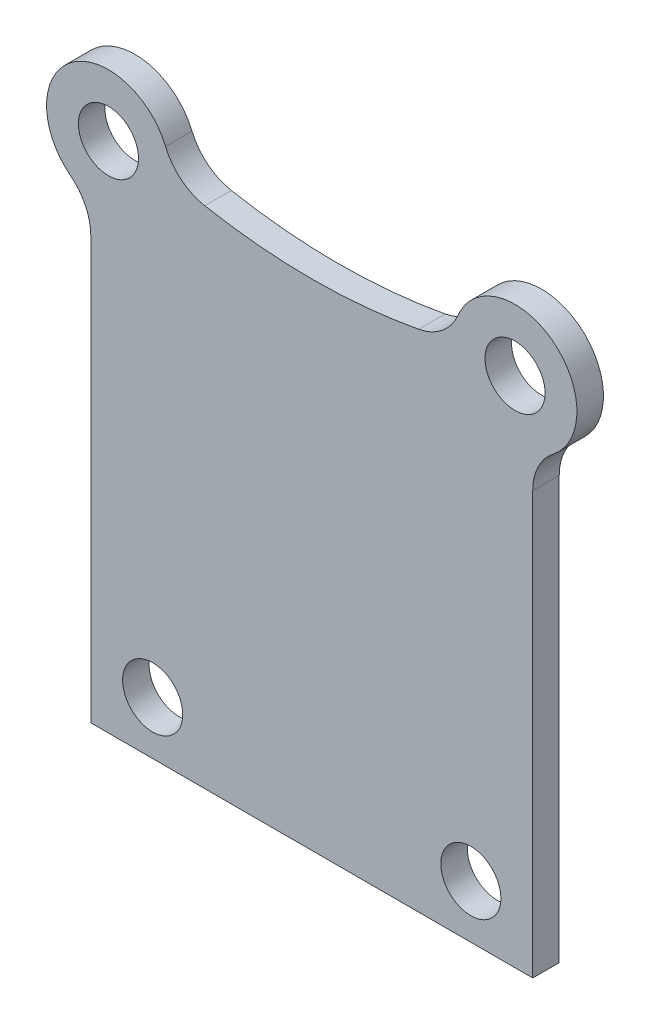
ISO-10303-21;
HEADER;
FILE_DESCRIPTION(('STEP AP214'),'2;1');
FILE_NAME('part.step','',(''),(''),'','','');
FILE_SCHEMA(('AUTOMOTIVE_DESIGN { 1 0 10303 214 1 1 1 1 }'));
ENDSEC;
DATA;
#1=APPLICATION_CONTEXT('core data for automotive mechanical design processes');
#2=APPLICATION_PROTOCOL_DEFINITION('international standard','automotive_design',2000,#1);
#3=PRODUCT_CONTEXT('',#1,'mechanical');
#4=PRODUCT('Part','Part','',(#3));
#5=PRODUCT_RELATED_PRODUCT_CATEGORY('part','',(#4));
#6=PRODUCT_DEFINITION_FORMATION('','',#4);
#7=PRODUCT_DEFINITION_CONTEXT('part definition',#1,'design');
#8=PRODUCT_DEFINITION('design','',#6,#7);
#9=PRODUCT_DEFINITION_SHAPE('','',#8);
#10=(LENGTH_UNIT() NAMED_UNIT(*) SI_UNIT(.MILLI.,.METRE.));
#11=(NAMED_UNIT(*) PLANE_ANGLE_UNIT() SI_UNIT($,.RADIAN.));
#12=(NAMED_UNIT(*) SI_UNIT($,.STERADIAN.) SOLID_ANGLE_UNIT());
#13=UNCERTAINTY_MEASURE_WITH_UNIT(LENGTH_MEASURE(1.E-05),#10,'distance_accuracy_value','');
#14=(GEOMETRIC_REPRESENTATION_CONTEXT(3) GLOBAL_UNCERTAINTY_ASSIGNED_CONTEXT((#13)) GLOBAL_UNIT_ASSIGNED_CONTEXT((#10,
#11,#12)) REPRESENTATION_CONTEXT('',''));
#15=CARTESIAN_POINT('',(0.,0.,0.));
#16=DIRECTION('',(0.,0.,1.));
#17=DIRECTION('',(1.,0.,0.));
#18=AXIS2_PLACEMENT_3D('',#15,#16,#17);
#19=CARTESIAN_POINT('',(-15.5,-56.1234753829798,-1.5));
#20=DIRECTION('',(0.,0.,1.));
#21=DIRECTION('',(1.,0.,0.));
#22=AXIS2_PLACEMENT_3D('',#19,#20,#21);
#23=CYLINDRICAL_SURFACE('',#22,3.);
#24=CARTESIAN_POINT('',(-15.5,-56.1234753829798,0.));
#25=DIRECTION('',(0.,0.,-1.));
#26=DIRECTION('',(1.,0.,0.));
#27=AXIS2_PLACEMENT_3D('',#24,#25,#26);
#28=CIRCLE('',#27,3.);
#29=CARTESIAN_POINT('',(-13.6538461538462,-53.7587944369891,0.));
#30=VERTEX_POINT('',#29);
#31=CARTESIAN_POINT('',(-12.5,-56.1234753829798,0.));
#32=VERTEX_POINT('',#31);
#33=EDGE_CURVE('E143',#30,#32,#28,.T.);
#34=ORIENTED_EDGE('',*,*,#33,.F.);
#35=DIRECTION('',(0.,0.,1.));
#36=VECTOR('',#35,1.);
#37=CARTESIAN_POINT('',(-13.6538461538462,-53.7587944369891,-1.5));
#38=LINE('',#37,#36);
#39=CARTESIAN_POINT('',(-13.6538461538462,-53.7587944369891,-1.5));
#40=VERTEX_POINT('',#39);
#41=EDGE_CURVE('E11',#40,#30,#38,.T.);
#42=ORIENTED_EDGE('',*,*,#41,.F.);
#43=CARTESIAN_POINT('',(-15.5,-56.1234753829798,-1.5));
#44=DIRECTION('',(0.,0.,-1.));
#45=DIRECTION('',(1.,0.,0.));
#46=AXIS2_PLACEMENT_3D('',#43,#44,#45);
#47=CIRCLE('',#46,3.);
#48=CARTESIAN_POINT('',(-12.5,-56.1234753829798,-1.5));
#49=VERTEX_POINT('',#48);
#50=EDGE_CURVE('E170',#40,#49,#47,.T.);
#51=ORIENTED_EDGE('',*,*,#50,.T.);
#52=DIRECTION('',(0.,0.,1.));
#53=VECTOR('',#52,1.);
#54=CARTESIAN_POINT('',(-12.5,-56.1234753829798,-1.5));
#55=LINE('',#54,#53);
#56=EDGE_CURVE('E37',#49,#32,#55,.T.);
#57=ORIENTED_EDGE('',*,*,#56,.T.);
#58=EDGE_LOOP('',(#34,#42,#51,#57));
#59=FACE_BOUND('',#58,.T.);
#60=ADVANCED_FACE('F34',(#59),#23,.F.);
#61=CARTESIAN_POINT('',(-11.5,-51.,-1.5));
#62=DIRECTION('',(0.,0.,1.));
#63=DIRECTION('',(1.,0.,0.));
#64=AXIS2_PLACEMENT_3D('',#61,#62,#63);
#65=CYLINDRICAL_SURFACE('',#64,3.50000000000001);
#66=CARTESIAN_POINT('',(-11.5,-51.,0.));
#67=DIRECTION('',(0.,0.,1.));
#68=DIRECTION('',(1.,0.,0.));
#69=AXIS2_PLACEMENT_3D('',#66,#67,#68);
#70=CIRCLE('',#69,3.50000000000001);
#71=CARTESIAN_POINT('',(-8.27038440674473,-49.6510807586062,0.));
#72=VERTEX_POINT('',#71);
#73=EDGE_CURVE('E168',#72,#30,#70,.T.);
#74=ORIENTED_EDGE('',*,*,#73,.F.);
#75=DIRECTION('',(0.,0.,1.));
#76=VECTOR('',#75,1.);
#77=CARTESIAN_POINT('',(-8.27038440674473,-49.6510807586062,-1.5));
#78=LINE('',#77,#76);
#79=CARTESIAN_POINT('',(-8.27038440674473,-49.6510807586062,-1.5));
#80=VERTEX_POINT('',#79);
#81=EDGE_CURVE('E43',#80,#72,#78,.T.);
#82=ORIENTED_EDGE('',*,*,#81,.F.);
#83=CARTESIAN_POINT('',(-11.5,-51.,-1.5));
#84=DIRECTION('',(0.,0.,1.));
#85=DIRECTION('',(1.,0.,0.));
#86=AXIS2_PLACEMENT_3D('',#83,#84,#85);
#87=CIRCLE('',#86,3.50000000000001);
#88=EDGE_CURVE('E133',#80,#40,#87,.T.);
#89=ORIENTED_EDGE('',*,*,#88,.T.);
#90=ORIENTED_EDGE('',*,*,#41,.T.);
#91=EDGE_LOOP('',(#74,#82,#89,#90));
#92=FACE_BOUND('',#91,.T.);
#93=ADVANCED_FACE('F186',(#92),#65,.T.);
#94=CARTESIAN_POINT('',(-5.50214246966879,-48.494864265983,-1.5));
#95=DIRECTION('',(0.,0.,1.));
#96=DIRECTION('',(1.,0.,0.));
#97=AXIS2_PLACEMENT_3D('',#94,#95,#96);
#98=CYLINDRICAL_SURFACE('',#97,3.);
#99=CARTESIAN_POINT('',(-5.50214246966879,-48.494864265983,0.));
#100=DIRECTION('',(0.,0.,-1.));
#101=DIRECTION('',(1.,0.,0.));
#102=AXIS2_PLACEMENT_3D('',#99,#100,#101);
#103=CIRCLE('',#102,3.);
#104=CARTESIAN_POINT('',(-6.05228930032564,-51.4439892997376,0.));
#105=VERTEX_POINT('',#104);
#106=EDGE_CURVE('E120',#105,#72,#103,.T.);
#107=ORIENTED_EDGE('',*,*,#106,.F.);
#108=DIRECTION('',(0.,0.,1.));
#109=VECTOR('',#108,1.);
#110=CARTESIAN_POINT('',(-6.05228930032564,-51.4439892997376,-1.5));
#111=LINE('',#110,#109);
#112=CARTESIAN_POINT('',(-6.05228930032564,-51.4439892997376,-1.5));
#113=VERTEX_POINT('',#112);
#114=EDGE_CURVE('E115',#113,#105,#111,.T.);
#115=ORIENTED_EDGE('',*,*,#114,.F.);
#116=CARTESIAN_POINT('',(-5.50214246966879,-48.494864265983,-1.5));
#117=DIRECTION('',(0.,0.,-1.));
#118=DIRECTION('',(1.,0.,0.));
#119=AXIS2_PLACEMENT_3D('',#116,#117,#118);
#120=CIRCLE('',#119,3.);
#121=EDGE_CURVE('E118',#113,#80,#120,.T.);
#122=ORIENTED_EDGE('',*,*,#121,.T.);
#123=ORIENTED_EDGE('',*,*,#81,.T.);
#124=EDGE_LOOP('',(#107,#115,#122,#123));
#125=FACE_BOUND('',#124,.T.);
#126=ADVANCED_FACE('F117',(#125),#98,.F.);
#127=CARTESIAN_POINT('',(0.,-19.,-1.5));
#128=DIRECTION('',(0.,0.,1.));
#129=DIRECTION('',(1.,0.,0.));
#130=AXIS2_PLACEMENT_3D('',#127,#128,#129);
#131=CYLINDRICAL_SURFACE('',#130,33.0036762718386);
#132=CARTESIAN_POINT('',(0.,-19.,0.));
#133=DIRECTION('',(0.,0.,-1.));
#134=DIRECTION('',(1.,0.,0.));
#135=AXIS2_PLACEMENT_3D('',#132,#133,#134);
#136=CIRCLE('',#135,33.0036762718386);
#137=CARTESIAN_POINT('',(6.05228930032564,-51.4439892997376,0.));
#138=VERTEX_POINT('',#137);
#139=EDGE_CURVE('E165',#138,#105,#136,.T.);
#140=ORIENTED_EDGE('',*,*,#139,.F.);
#141=DIRECTION('',(0.,0.,1.));
#142=VECTOR('',#141,1.);
#143=CARTESIAN_POINT('',(6.05228930032564,-51.4439892997376,-1.5));
#144=LINE('',#143,#142);
#145=CARTESIAN_POINT('',(6.05228930032564,-51.4439892997376,-1.5));
#146=VERTEX_POINT('',#145);
#147=EDGE_CURVE('E125',#146,#138,#144,.T.);
#148=ORIENTED_EDGE('',*,*,#147,.F.);
#149=CARTESIAN_POINT('',(0.,-19.,-1.5));
#150=DIRECTION('',(0.,0.,-1.));
#151=DIRECTION('',(1.,0.,0.));
#152=AXIS2_PLACEMENT_3D('',#149,#150,#151);
#153=CIRCLE('',#152,33.0036762718386);
#154=EDGE_CURVE('E131',#146,#113,#153,.T.);
#155=ORIENTED_EDGE('',*,*,#154,.T.);
#156=ORIENTED_EDGE('',*,*,#114,.T.);
#157=EDGE_LOOP('',(#140,#148,#155,#156));
#158=FACE_BOUND('',#157,.T.);
#159=ADVANCED_FACE('F135',(#158),#131,.F.);
#160=CARTESIAN_POINT('',(5.50214246966878,-48.494864265983,-1.5));
#161=DIRECTION('',(0.,0.,1.));
#162=DIRECTION('',(1.,0.,0.));
#163=AXIS2_PLACEMENT_3D('',#160,#161,#162);
#164=CYLINDRICAL_SURFACE('',#163,3.);
#165=CARTESIAN_POINT('',(5.50214246966878,-48.494864265983,0.));
#166=DIRECTION('',(0.,0.,-1.));
#167=DIRECTION('',(1.,0.,0.));
#168=AXIS2_PLACEMENT_3D('',#165,#166,#167);
#169=CIRCLE('',#168,3.);
#170=CARTESIAN_POINT('',(8.27038440674472,-49.6510807586062,0.));
#171=VERTEX_POINT('',#170);
#172=EDGE_CURVE('E162',#171,#138,#169,.T.);
#173=ORIENTED_EDGE('',*,*,#172,.F.);
#174=DIRECTION('',(0.,0.,1.));
#175=VECTOR('',#174,1.);
#176=CARTESIAN_POINT('',(8.27038440674472,-49.6510807586062,-1.5));
#177=LINE('',#176,#175);
#178=CARTESIAN_POINT('',(8.27038440674472,-49.6510807586062,-1.5));
#179=VERTEX_POINT('',#178);
#180=EDGE_CURVE('E174',#179,#171,#177,.T.);
#181=ORIENTED_EDGE('',*,*,#180,.F.);
#182=CARTESIAN_POINT('',(5.50214246966878,-48.494864265983,-1.5));
#183=DIRECTION('',(0.,0.,-1.));
#184=DIRECTION('',(1.,0.,0.));
#185=AXIS2_PLACEMENT_3D('',#182,#183,#184);
#186=CIRCLE('',#185,3.);
#187=EDGE_CURVE('E136',#179,#146,#186,.T.);
#188=ORIENTED_EDGE('',*,*,#187,.T.);
#189=ORIENTED_EDGE('',*,*,#147,.T.);
#190=EDGE_LOOP('',(#173,#181,#188,#189));
#191=FACE_BOUND('',#190,.T.);
#192=ADVANCED_FACE('F199',(#191),#164,.F.);
#193=CARTESIAN_POINT('',(11.5,-51.,-1.5));
#194=DIRECTION('',(0.,0.,1.));
#195=DIRECTION('',(1.,0.,0.));
#196=AXIS2_PLACEMENT_3D('',#193,#194,#195);
#197=CYLINDRICAL_SURFACE('',#196,3.5);
#198=CARTESIAN_POINT('',(11.5,-51.,0.));
#199=DIRECTION('',(0.,0.,1.));
#200=DIRECTION('',(1.,0.,0.));
#201=AXIS2_PLACEMENT_3D('',#198,#199,#200);
#202=CIRCLE('',#201,3.5);
#203=CARTESIAN_POINT('',(13.6538461538462,-53.7587944369891,0.));
#204=VERTEX_POINT('',#203);
#205=EDGE_CURVE('E159',#204,#171,#202,.T.);
#206=ORIENTED_EDGE('',*,*,#205,.F.);
#207=DIRECTION('',(0.,0.,1.));
#208=VECTOR('',#207,1.);
#209=CARTESIAN_POINT('',(13.6538461538462,-53.7587944369891,-1.5));
#210=LINE('',#209,#208);
#211=CARTESIAN_POINT('',(13.6538461538462,-53.7587944369891,-1.5));
#212=VERTEX_POINT('',#211);
#213=EDGE_CURVE('E176',#212,#204,#210,.T.);
#214=ORIENTED_EDGE('',*,*,#213,.F.);
#215=CARTESIAN_POINT('',(11.5,-51.,-1.5));
#216=DIRECTION('',(0.,0.,1.));
#217=DIRECTION('',(1.,0.,0.));
#218=AXIS2_PLACEMENT_3D('',#215,#216,#217);
#219=CIRCLE('',#218,3.5);
#220=EDGE_CURVE('E138',#212,#179,#219,.T.);
#221=ORIENTED_EDGE('',*,*,#220,.T.);
#222=ORIENTED_EDGE('',*,*,#180,.T.);
#223=EDGE_LOOP('',(#206,#214,#221,#222));
#224=FACE_BOUND('',#223,.T.);
#225=ADVANCED_FACE('F202',(#224),#197,.T.);
#226=CARTESIAN_POINT('',(15.5,-56.1234753829798,-1.5));
#227=DIRECTION('',(0.,0.,1.));
#228=DIRECTION('',(1.,0.,0.));
#229=AXIS2_PLACEMENT_3D('',#226,#227,#228);
#230=CYLINDRICAL_SURFACE('',#229,3.);
#231=CARTESIAN_POINT('',(15.5,-56.1234753829798,0.));
#232=DIRECTION('',(0.,0.,-1.));
#233=DIRECTION('',(1.,0.,0.));
#234=AXIS2_PLACEMENT_3D('',#231,#232,#233);
#235=CIRCLE('',#234,3.);
#236=CARTESIAN_POINT('',(12.5,-56.1234753829798,0.));
#237=VERTEX_POINT('',#236);
#238=EDGE_CURVE('E156',#237,#204,#235,.T.);
#239=ORIENTED_EDGE('',*,*,#238,.F.);
#240=DIRECTION('',(0.,0.,1.));
#241=VECTOR('',#240,1.);
#242=CARTESIAN_POINT('',(12.5,-56.1234753829798,-1.5));
#243=LINE('',#242,#241);
#244=CARTESIAN_POINT('',(12.5,-56.1234753829798,-1.5));
#245=VERTEX_POINT('',#244);
#246=EDGE_CURVE('E178',#245,#237,#243,.T.);
#247=ORIENTED_EDGE('',*,*,#246,.F.);
#248=CARTESIAN_POINT('',(15.5,-56.1234753829798,-1.5));
#249=DIRECTION('',(0.,0.,-1.));
#250=DIRECTION('',(1.,0.,0.));
#251=AXIS2_PLACEMENT_3D('',#248,#249,#250);
#252=CIRCLE('',#251,3.);
#253=EDGE_CURVE('E282',#245,#212,#252,.T.);
#254=ORIENTED_EDGE('',*,*,#253,.T.);
#255=ORIENTED_EDGE('',*,*,#213,.T.);
#256=EDGE_LOOP('',(#239,#247,#254,#255));
#257=FACE_BOUND('',#256,.T.);
#258=ADVANCED_FACE('F206',(#257),#230,.F.);
#259=CARTESIAN_POINT('',(12.5,-80.,-1.5));
#260=DIRECTION('',(1.,0.,0.));
#261=DIRECTION('',(0.,1.,0.));
#262=AXIS2_PLACEMENT_3D('',#259,#260,#261);
#263=PLANE('',#262);
#264=DIRECTION('',(0.,1.,0.));
#265=VECTOR('',#264,1.);
#266=CARTESIAN_POINT('',(12.5,-80.,0.));
#267=LINE('',#266,#265);
#268=CARTESIAN_POINT('',(12.5,-80.,0.));
#269=VERTEX_POINT('',#268);
#270=EDGE_CURVE('E153',#269,#237,#267,.T.);
#271=ORIENTED_EDGE('',*,*,#270,.F.);
#272=DIRECTION('',(0.,0.,1.));
#273=VECTOR('',#272,1.);
#274=CARTESIAN_POINT('',(12.5,-80.,-1.5));
#275=LINE('',#274,#273);
#276=CARTESIAN_POINT('',(12.5,-80.,-1.5));
#277=VERTEX_POINT('',#276);
#278=EDGE_CURVE('E180',#277,#269,#275,.T.);
#279=ORIENTED_EDGE('',*,*,#278,.F.);
#280=DIRECTION('',(0.,1.,0.));
#281=VECTOR('',#280,1.);
#282=CARTESIAN_POINT('',(12.5,-80.,-1.5));
#283=LINE('',#282,#281);
#284=EDGE_CURVE('E279',#277,#245,#283,.T.);
#285=ORIENTED_EDGE('',*,*,#284,.T.);
#286=ORIENTED_EDGE('',*,*,#246,.T.);
#287=EDGE_LOOP('',(#271,#279,#285,#286));
#288=FACE_BOUND('',#287,.T.);
#289=ADVANCED_FACE('F210',(#288),#263,.T.);
#290=CARTESIAN_POINT('',(-12.5,-80.,-1.5));
#291=DIRECTION('',(0.,-1.,0.));
#292=DIRECTION('',(0.,0.,-1.));
#293=AXIS2_PLACEMENT_3D('',#290,#291,#292);
#294=PLANE('',#293);
#295=DIRECTION('',(1.,0.,0.));
#296=VECTOR('',#295,1.);
#297=CARTESIAN_POINT('',(-12.5,-80.,0.));
#298=LINE('',#297,#296);
#299=CARTESIAN_POINT('',(-12.5,-80.,0.));
#300=VERTEX_POINT('',#299);
#301=EDGE_CURVE('E150',#300,#269,#298,.T.);
#302=ORIENTED_EDGE('',*,*,#301,.F.);
#303=DIRECTION('',(0.,0.,1.));
#304=VECTOR('',#303,1.);
#305=CARTESIAN_POINT('',(-12.5,-80.,-1.5));
#306=LINE('',#305,#304);
#307=CARTESIAN_POINT('',(-12.5,-80.,-1.5));
#308=VERTEX_POINT('',#307);
#309=EDGE_CURVE('E181',#308,#300,#306,.T.);
#310=ORIENTED_EDGE('',*,*,#309,.F.);
#311=DIRECTION('',(1.,0.,0.));
#312=VECTOR('',#311,1.);
#313=CARTESIAN_POINT('',(-12.5,-80.,-1.5));
#314=LINE('',#313,#312);
#315=EDGE_CURVE('E276',#308,#277,#314,.T.);
#316=ORIENTED_EDGE('',*,*,#315,.T.);
#317=ORIENTED_EDGE('',*,*,#278,.T.);
#318=EDGE_LOOP('',(#302,#310,#316,#317));
#319=FACE_BOUND('',#318,.T.);
#320=ADVANCED_FACE('F214',(#319),#294,.T.);
#321=CARTESIAN_POINT('',(-12.5,-56.1234753829798,-1.5));
#322=DIRECTION('',(-1.,0.,0.));
#323=DIRECTION('',(0.,0.,1.));
#324=AXIS2_PLACEMENT_3D('',#321,#322,#323);
#325=PLANE('',#324);
#326=DIRECTION('',(0.,-1.,0.));
#327=VECTOR('',#326,1.);
#328=CARTESIAN_POINT('',(-12.5,-56.1234753829798,0.));
#329=LINE('',#328,#327);
#330=EDGE_CURVE('E146',#32,#300,#329,.T.);
#331=ORIENTED_EDGE('',*,*,#330,.F.);
#332=ORIENTED_EDGE('',*,*,#56,.F.);
#333=DIRECTION('',(0.,-1.,0.));
#334=VECTOR('',#333,1.);
#335=CARTESIAN_POINT('',(-12.5,-56.1234753829798,-1.5));
#336=LINE('',#335,#334);
#337=EDGE_CURVE('E274',#49,#308,#336,.T.);
#338=ORIENTED_EDGE('',*,*,#337,.T.);
#339=ORIENTED_EDGE('',*,*,#309,.T.);
#340=EDGE_LOOP('',(#331,#332,#338,#339));
#341=FACE_BOUND('',#340,.T.);
#342=ADVANCED_FACE('F183',(#341),#325,.T.);
#343=CARTESIAN_POINT('',(-15.5,-56.1234753829798,-1.5));
#344=DIRECTION('',(0.,0.,1.));
#345=DIRECTION('',(1.,0.,0.));
#346=AXIS2_PLACEMENT_3D('',#343,#344,#345);
#347=PLANE('',#346);
#348=CARTESIAN_POINT('',(11.5,-51.,-1.5));
#349=DIRECTION('',(0.,0.,1.));
#350=DIRECTION('',(1.,0.,0.));
#351=AXIS2_PLACEMENT_3D('',#348,#349,#350);
#352=CIRCLE('',#351,1.69999999999999);
#353=CARTESIAN_POINT('',(13.2,-51.,-1.5));
#354=VERTEX_POINT('',#353);
#355=EDGE_CURVE('E249',#354,#354,#352,.T.);
#356=ORIENTED_EDGE('',*,*,#355,.T.);
#357=EDGE_LOOP('',(#356));
#358=FACE_BOUND('',#357,.T.);
#359=CARTESIAN_POINT('',(-11.5,-51.,-1.5));
#360=DIRECTION('',(0.,0.,1.));
#361=DIRECTION('',(1.,0.,0.));
#362=AXIS2_PLACEMENT_3D('',#359,#360,#361);
#363=CIRCLE('',#362,1.69999999999999);
#364=CARTESIAN_POINT('',(-9.80000000000001,-51.,-1.5));
#365=VERTEX_POINT('',#364);
#366=EDGE_CURVE('E259',#365,#365,#363,.T.);
#367=ORIENTED_EDGE('',*,*,#366,.T.);
#368=EDGE_LOOP('',(#367));
#369=FACE_BOUND('',#368,.T.);
#370=CARTESIAN_POINT('',(9.,-77.,-1.5));
#371=DIRECTION('',(0.,0.,1.));
#372=DIRECTION('',(1.,0.,0.));
#373=AXIS2_PLACEMENT_3D('',#370,#371,#372);
#374=CIRCLE('',#373,1.69999999999999);
#375=CARTESIAN_POINT('',(10.7,-77.,-1.5));
#376=VERTEX_POINT('',#375);
#377=EDGE_CURVE('E265',#376,#376,#374,.T.);
#378=ORIENTED_EDGE('',*,*,#377,.T.);
#379=EDGE_LOOP('',(#378));
#380=FACE_BOUND('',#379,.T.);
#381=CARTESIAN_POINT('',(-9.00000000000001,-77.,-1.5));
#382=DIRECTION('',(0.,0.,1.));
#383=DIRECTION('',(1.,0.,0.));
#384=AXIS2_PLACEMENT_3D('',#381,#382,#383);
#385=CIRCLE('',#384,1.69999999999999);
#386=CARTESIAN_POINT('',(-7.30000000000001,-77.,-1.5));
#387=VERTEX_POINT('',#386);
#388=EDGE_CURVE('E147',#387,#387,#385,.T.);
#389=ORIENTED_EDGE('',*,*,#388,.T.);
#390=EDGE_LOOP('',(#389));
#391=FACE_BOUND('',#390,.T.);
#392=ORIENTED_EDGE('',*,*,#50,.F.);
#393=ORIENTED_EDGE('',*,*,#88,.F.);
#394=ORIENTED_EDGE('',*,*,#121,.F.);
#395=ORIENTED_EDGE('',*,*,#154,.F.);
#396=ORIENTED_EDGE('',*,*,#187,.F.);
#397=ORIENTED_EDGE('',*,*,#220,.F.);
#398=ORIENTED_EDGE('',*,*,#253,.F.);
#399=ORIENTED_EDGE('',*,*,#284,.F.);
#400=ORIENTED_EDGE('',*,*,#315,.F.);
#401=ORIENTED_EDGE('',*,*,#337,.F.);
#402=EDGE_LOOP('',(#392,#393,#394,#395,#396,#397,#398,#399,#400,#401));
#403=FACE_BOUND('',#402,.T.);
#404=ADVANCED_FACE('F129',(#358,#369,#380,#391,#403),#347,.F.);
#405=CARTESIAN_POINT('',(-15.5,-56.1234753829798,0.));
#406=DIRECTION('',(0.,0.,1.));
#407=DIRECTION('',(1.,0.,0.));
#408=AXIS2_PLACEMENT_3D('',#405,#406,#407);
#409=PLANE('',#408);
#410=CARTESIAN_POINT('',(11.5,-51.,0.));
#411=DIRECTION('',(0.,0.,1.));
#412=DIRECTION('',(1.,0.,0.));
#413=AXIS2_PLACEMENT_3D('',#410,#411,#412);
#414=CIRCLE('',#413,1.69999999999999);
#415=CARTESIAN_POINT('',(13.2,-51.,0.));
#416=VERTEX_POINT('',#415);
#417=EDGE_CURVE('E252',#416,#416,#414,.T.);
#418=ORIENTED_EDGE('',*,*,#417,.F.);
#419=EDGE_LOOP('',(#418));
#420=FACE_BOUND('',#419,.T.);
#421=CARTESIAN_POINT('',(-11.5,-51.,0.));
#422=DIRECTION('',(0.,0.,1.));
#423=DIRECTION('',(1.,0.,0.));
#424=AXIS2_PLACEMENT_3D('',#421,#422,#423);
#425=CIRCLE('',#424,1.69999999999999);
#426=CARTESIAN_POINT('',(-9.80000000000001,-51.,0.));
#427=VERTEX_POINT('',#426);
#428=EDGE_CURVE('E254',#427,#427,#425,.T.);
#429=ORIENTED_EDGE('',*,*,#428,.F.);
#430=EDGE_LOOP('',(#429));
#431=FACE_BOUND('',#430,.T.);
#432=CARTESIAN_POINT('',(9.,-77.,0.));
#433=DIRECTION('',(0.,0.,1.));
#434=DIRECTION('',(1.,0.,0.));
#435=AXIS2_PLACEMENT_3D('',#432,#433,#434);
#436=CIRCLE('',#435,1.69999999999999);
#437=CARTESIAN_POINT('',(10.7,-77.,0.));
#438=VERTEX_POINT('',#437);
#439=EDGE_CURVE('E262',#438,#438,#436,.T.);
#440=ORIENTED_EDGE('',*,*,#439,.F.);
#441=EDGE_LOOP('',(#440));
#442=FACE_BOUND('',#441,.T.);
#443=CARTESIAN_POINT('',(-9.00000000000001,-77.,0.));
#444=DIRECTION('',(0.,0.,1.));
#445=DIRECTION('',(1.,0.,0.));
#446=AXIS2_PLACEMENT_3D('',#443,#444,#445);
#447=CIRCLE('',#446,1.69999999999999);
#448=CARTESIAN_POINT('',(-7.30000000000002,-77.,0.));
#449=VERTEX_POINT('',#448);
#450=EDGE_CURVE('E268',#449,#449,#447,.T.);
#451=ORIENTED_EDGE('',*,*,#450,.F.);
#452=EDGE_LOOP('',(#451));
#453=FACE_BOUND('',#452,.T.);
#454=ORIENTED_EDGE('',*,*,#33,.T.);
#455=ORIENTED_EDGE('',*,*,#330,.T.);
#456=ORIENTED_EDGE('',*,*,#301,.T.);
#457=ORIENTED_EDGE('',*,*,#270,.T.);
#458=ORIENTED_EDGE('',*,*,#238,.T.);
#459=ORIENTED_EDGE('',*,*,#205,.T.);
#460=ORIENTED_EDGE('',*,*,#172,.T.);
#461=ORIENTED_EDGE('',*,*,#139,.T.);
#462=ORIENTED_EDGE('',*,*,#106,.T.);
#463=ORIENTED_EDGE('',*,*,#73,.T.);
#464=EDGE_LOOP('',(#454,#455,#456,#457,#458,#459,#460,#461,#462,#463));
#465=FACE_BOUND('',#464,.T.);
#466=ADVANCED_FACE('F185',(#420,#431,#442,#453,#465),#409,.T.);
#467=CARTESIAN_POINT('',(-9.00000000000001,-77.,0.));
#468=DIRECTION('',(0.,0.,1.));
#469=DIRECTION('',(1.,0.,0.));
#470=AXIS2_PLACEMENT_3D('',#467,#468,#469);
#471=CYLINDRICAL_SURFACE('',#470,1.69999999999999);
#472=ORIENTED_EDGE('',*,*,#388,.F.);
#473=EDGE_LOOP('',(#472));
#474=FACE_BOUND('',#473,.T.);
#475=ORIENTED_EDGE('',*,*,#450,.T.);
#476=EDGE_LOOP('',(#475));
#477=FACE_BOUND('',#476,.T.);
#478=ADVANCED_FACE('F226',(#474,#477),#471,.F.);
#479=CARTESIAN_POINT('',(9.,-77.,0.));
#480=DIRECTION('',(0.,0.,1.));
#481=DIRECTION('',(1.,0.,0.));
#482=AXIS2_PLACEMENT_3D('',#479,#480,#481);
#483=CYLINDRICAL_SURFACE('',#482,1.69999999999999);
#484=ORIENTED_EDGE('',*,*,#377,.F.);
#485=EDGE_LOOP('',(#484));
#486=FACE_BOUND('',#485,.T.);
#487=ORIENTED_EDGE('',*,*,#439,.T.);
#488=EDGE_LOOP('',(#487));
#489=FACE_BOUND('',#488,.T.);
#490=ADVANCED_FACE('F233',(#486,#489),#483,.F.);
#491=CARTESIAN_POINT('',(-11.5,-51.,0.));
#492=DIRECTION('',(0.,0.,1.));
#493=DIRECTION('',(1.,0.,0.));
#494=AXIS2_PLACEMENT_3D('',#491,#492,#493);
#495=CYLINDRICAL_SURFACE('',#494,1.69999999999999);
#496=ORIENTED_EDGE('',*,*,#366,.F.);
#497=EDGE_LOOP('',(#496));
#498=FACE_BOUND('',#497,.T.);
#499=ORIENTED_EDGE('',*,*,#428,.T.);
#500=EDGE_LOOP('',(#499));
#501=FACE_BOUND('',#500,.T.);
#502=ADVANCED_FACE('F237',(#498,#501),#495,.F.);
#503=CARTESIAN_POINT('',(11.5,-51.,0.));
#504=DIRECTION('',(0.,0.,1.));
#505=DIRECTION('',(1.,0.,0.));
#506=AXIS2_PLACEMENT_3D('',#503,#504,#505);
#507=CYLINDRICAL_SURFACE('',#506,1.69999999999999);
#508=ORIENTED_EDGE('',*,*,#355,.F.);
#509=EDGE_LOOP('',(#508));
#510=FACE_BOUND('',#509,.T.);
#511=ORIENTED_EDGE('',*,*,#417,.T.);
#512=EDGE_LOOP('',(#511));
#513=FACE_BOUND('',#512,.T.);
#514=ADVANCED_FACE('F241',(#510,#513),#507,.F.);
#515=CLOSED_SHELL('',(#60,#93,#126,#159,#192,#225,#258,#289,#320,#342,#404,#466,#478,#490,#502,#514));
#516=MANIFOLD_SOLID_BREP('B2',#515);
#517=ADVANCED_BREP_SHAPE_REPRESENTATION('',(#18,#516),#14);
#518=SHAPE_DEFINITION_REPRESENTATION(#9,#517);
ENDSEC;
END-ISO-10303-21;
